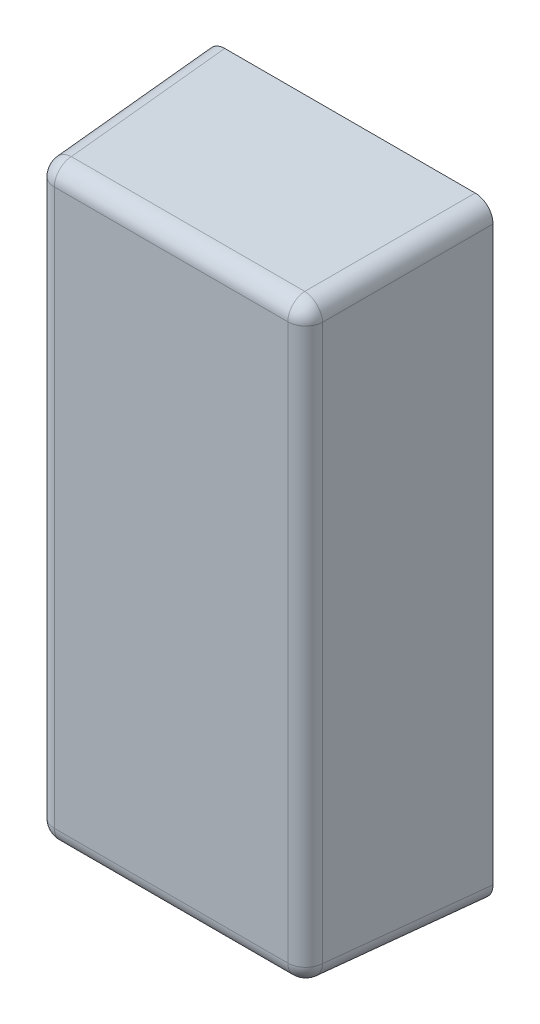
ISO-10303-21;
HEADER;
FILE_DESCRIPTION(('STEP AP214'),'2;1');
FILE_NAME('part.step','',(''),(''),'','','');
FILE_SCHEMA(('AUTOMOTIVE_DESIGN { 1 0 10303 214 1 1 1 1 }'));
ENDSEC;
DATA;
#1=APPLICATION_CONTEXT('core data for automotive mechanical design processes');
#2=APPLICATION_PROTOCOL_DEFINITION('international standard','automotive_design',2000,#1);
#3=PRODUCT_CONTEXT('',#1,'mechanical');
#4=PRODUCT('Part','Part','',(#3));
#5=PRODUCT_RELATED_PRODUCT_CATEGORY('part','',(#4));
#6=PRODUCT_DEFINITION_FORMATION('','',#4);
#7=PRODUCT_DEFINITION_CONTEXT('part definition',#1,'design');
#8=PRODUCT_DEFINITION('design','',#6,#7);
#9=PRODUCT_DEFINITION_SHAPE('','',#8);
#10=(LENGTH_UNIT() NAMED_UNIT(*) SI_UNIT(.MILLI.,.METRE.));
#11=(NAMED_UNIT(*) PLANE_ANGLE_UNIT() SI_UNIT($,.RADIAN.));
#12=(NAMED_UNIT(*) SI_UNIT($,.STERADIAN.) SOLID_ANGLE_UNIT());
#13=UNCERTAINTY_MEASURE_WITH_UNIT(LENGTH_MEASURE(1.E-05),#10,'distance_accuracy_value','');
#14=(GEOMETRIC_REPRESENTATION_CONTEXT(3) GLOBAL_UNCERTAINTY_ASSIGNED_CONTEXT((#13)) GLOBAL_UNIT_ASSIGNED_CONTEXT((#10,
#11,#12)) REPRESENTATION_CONTEXT('',''));
#15=CARTESIAN_POINT('',(0.,0.,0.));
#16=DIRECTION('',(0.,0.,1.));
#17=DIRECTION('',(1.,0.,0.));
#18=AXIS2_PLACEMENT_3D('',#15,#16,#17);
#19=CARTESIAN_POINT('',(-8.,-17.,0.));
#20=DIRECTION('',(-0.998629534754574,0.,0.0523359562429439));
#21=DIRECTION('',(0.052335956242944,0.,0.998629534754574));
#22=AXIS2_PLACEMENT_3D('',#19,#20,#21);
#23=PLANE('',#22);
#24=DIRECTION('',(0.,-1.,0.));
#25=VECTOR('',#24,1.);
#26=CARTESIAN_POINT('',(-8.,-17.,0.));
#27=LINE('',#26,#25);
#28=CARTESIAN_POINT('',(-8.,16.0013704652454,0.));
#29=VERTEX_POINT('',#28);
#30=CARTESIAN_POINT('',(-8.,-16.0013704652454,0.));
#31=VERTEX_POINT('',#30);
#32=EDGE_CURVE('E177',#29,#31,#27,.T.);
#33=ORIENTED_EDGE('',*,*,#32,.T.);
#34=DIRECTION('',(0.052264427688714,0.0522644276887141,0.997264688634237));
#35=VECTOR('',#34,1.);
#36=CARTESIAN_POINT('',(-8.00272782687933,-16.0040982921248,-0.0520500375449156));
#37=LINE('',#36,#35);
#38=CARTESIAN_POINT('',(-7.52558717520928,-15.5269576404547,9.05233595624295));
#39=VERTEX_POINT('',#38);
#40=EDGE_CURVE('E215',#31,#39,#37,.T.);
#41=ORIENTED_EDGE('',*,*,#40,.T.);
#42=DIRECTION('',(0.,-1.,0.));
#43=VECTOR('',#42,1.);
#44=CARTESIAN_POINT('',(-7.52558717520928,16.4759222071696,9.05233595624295));
#45=LINE('',#44,#43);
#46=CARTESIAN_POINT('',(-7.52558717520928,15.5269576404547,9.05233595624295));
#47=VERTEX_POINT('',#46);
#48=EDGE_CURVE('E213',#39,#47,#45,.F.);
#49=ORIENTED_EDGE('',*,*,#48,.T.);
#50=DIRECTION('',(0.052264427688714,-0.052264427688714,0.997264688634237));
#51=VECTOR('',#50,1.);
#52=CARTESIAN_POINT('',(-7.90985443322395,15.9112248984694,1.72007988144657));
#53=LINE('',#52,#51);
#54=EDGE_CURVE('E211',#47,#29,#53,.F.);
#55=ORIENTED_EDGE('',*,*,#54,.T.);
#56=EDGE_LOOP('',(#33,#41,#49,#55));
#57=FACE_BOUND('',#56,.T.);
#58=ADVANCED_FACE('F33',(#57),#23,.T.);
#59=CARTESIAN_POINT('',(8.,-17.,0.));
#60=DIRECTION('',(0.,-0.998629534754574,0.0523359562429439));
#61=DIRECTION('',(0.,-0.052335956242944,-0.998629534754574));
#62=AXIS2_PLACEMENT_3D('',#59,#60,#61);
#63=PLANE('',#62);
#64=DIRECTION('',(1.,0.,0.));
#65=VECTOR('',#64,1.);
#66=CARTESIAN_POINT('',(8.,-17.,0.));
#67=LINE('',#66,#65);
#68=CARTESIAN_POINT('',(-7.00137046524542,-17.,0.));
#69=VERTEX_POINT('',#68);
#70=CARTESIAN_POINT('',(7.00137046524543,-17.,0.));
#71=VERTEX_POINT('',#70);
#72=EDGE_CURVE('E180',#69,#71,#67,.T.);
#73=ORIENTED_EDGE('',*,*,#72,.T.);
#74=DIRECTION('',(-0.052264427688714,0.052264427688714,0.997264688634237));
#75=VECTOR('',#74,1.);
#76=CARTESIAN_POINT('',(7.00409829212476,-17.0027278268793,-0.0520500375449156));
#77=LINE('',#76,#75);
#78=CARTESIAN_POINT('',(6.52695764045471,-16.5255871752093,9.05233595624295));
#79=VERTEX_POINT('',#78);
#80=EDGE_CURVE('E203',#71,#79,#77,.T.);
#81=ORIENTED_EDGE('',*,*,#80,.T.);
#82=DIRECTION('',(1.,0.,0.));
#83=VECTOR('',#82,1.);
#84=CARTESIAN_POINT('',(-7.47592220716958,-16.5255871752093,9.05233595624295));
#85=LINE('',#84,#83);
#86=CARTESIAN_POINT('',(-6.5269576404547,-16.5255871752093,9.05233595624295));
#87=VERTEX_POINT('',#86);
#88=EDGE_CURVE('E200',#79,#87,#85,.F.);
#89=ORIENTED_EDGE('',*,*,#88,.T.);
#90=DIRECTION('',(0.0522644276887141,0.0522644276887141,0.997264688634237));
#91=VECTOR('',#90,1.);
#92=CARTESIAN_POINT('',(-6.96039316569869,-16.9590227004533,0.781893453745197));
#93=LINE('',#92,#91);
#94=EDGE_CURVE('E198',#87,#69,#93,.F.);
#95=ORIENTED_EDGE('',*,*,#94,.T.);
#96=EDGE_LOOP('',(#73,#81,#89,#95));
#97=FACE_BOUND('',#96,.T.);
#98=ADVANCED_FACE('F312',(#97),#63,.T.);
#99=CARTESIAN_POINT('',(8.,-17.,0.));
#100=DIRECTION('',(0.998629534754574,0.,0.0523359562429439));
#101=DIRECTION('',(0.052335956242944,0.,-0.998629534754574));
#102=AXIS2_PLACEMENT_3D('',#99,#100,#101);
#103=PLANE('',#102);
#104=DIRECTION('',(0.,1.,0.));
#105=VECTOR('',#104,1.);
#106=CARTESIAN_POINT('',(8.,-17.,0.));
#107=LINE('',#106,#105);
#108=CARTESIAN_POINT('',(8.,-16.0013704652454,0.));
#109=VERTEX_POINT('',#108);
#110=CARTESIAN_POINT('',(8.,16.0013704652454,0.));
#111=VERTEX_POINT('',#110);
#112=EDGE_CURVE('E184',#109,#111,#107,.T.);
#113=ORIENTED_EDGE('',*,*,#112,.T.);
#114=DIRECTION('',(-0.052264427688714,-0.0522644276887141,0.997264688634237));
#115=VECTOR('',#114,1.);
#116=CARTESIAN_POINT('',(7.90985443322395,15.9112248984694,1.72007988144657));
#117=LINE('',#116,#115);
#118=CARTESIAN_POINT('',(7.52558717520928,15.5269576404547,9.05233595624295));
#119=VERTEX_POINT('',#118);
#120=EDGE_CURVE('E56',#111,#119,#117,.T.);
#121=ORIENTED_EDGE('',*,*,#120,.T.);
#122=DIRECTION('',(0.,1.,0.));
#123=VECTOR('',#122,1.);
#124=CARTESIAN_POINT('',(7.52558717520928,-16.4759222071696,9.05233595624295));
#125=LINE('',#124,#123);
#126=CARTESIAN_POINT('',(7.52558717520928,-15.5269576404547,9.05233595624295));
#127=VERTEX_POINT('',#126);
#128=EDGE_CURVE('E219',#119,#127,#125,.F.);
#129=ORIENTED_EDGE('',*,*,#128,.T.);
#130=DIRECTION('',(-0.052264427688714,0.052264427688714,0.997264688634237));
#131=VECTOR('',#130,1.);
#132=CARTESIAN_POINT('',(8.00272782687933,-16.0040982921248,-0.0520500375449156));
#133=LINE('',#132,#131);
#134=EDGE_CURVE('E217',#127,#109,#133,.F.);
#135=ORIENTED_EDGE('',*,*,#134,.T.);
#136=EDGE_LOOP('',(#113,#121,#129,#135));
#137=FACE_BOUND('',#136,.T.);
#138=ADVANCED_FACE('F295',(#137),#103,.T.);
#139=CARTESIAN_POINT('',(8.,17.,0.));
#140=DIRECTION('',(0.,0.998629534754574,0.0523359562429439));
#141=DIRECTION('',(0.,-0.052335956242944,0.998629534754574));
#142=AXIS2_PLACEMENT_3D('',#139,#140,#141);
#143=PLANE('',#142);
#144=DIRECTION('',(-1.,0.,0.));
#145=VECTOR('',#144,1.);
#146=CARTESIAN_POINT('',(7.47592220716959,16.5255871752093,9.05233595624294));
#147=LINE('',#146,#145);
#148=CARTESIAN_POINT('',(-6.5269576404547,16.5255871752093,9.05233595624294));
#149=VERTEX_POINT('',#148);
#150=CARTESIAN_POINT('',(6.52695764045471,16.5255871752093,9.05233595624294));
#151=VERTEX_POINT('',#150);
#152=EDGE_CURVE('E207',#149,#151,#147,.F.);
#153=ORIENTED_EDGE('',*,*,#152,.T.);
#154=DIRECTION('',(-0.0522644276887141,-0.0522644276887141,0.997264688634237));
#155=VECTOR('',#154,1.);
#156=CARTESIAN_POINT('',(7.00409829212476,17.0027278268793,-0.0520500375449156));
#157=LINE('',#156,#155);
#158=CARTESIAN_POINT('',(7.00137046524543,17.,0.));
#159=VERTEX_POINT('',#158);
#160=EDGE_CURVE('E209',#151,#159,#157,.F.);
#161=ORIENTED_EDGE('',*,*,#160,.T.);
#162=DIRECTION('',(-1.,0.,0.));
#163=VECTOR('',#162,1.);
#164=CARTESIAN_POINT('',(8.,17.,0.));
#165=LINE('',#164,#163);
#166=CARTESIAN_POINT('',(-7.00137046524542,17.,0.));
#167=VERTEX_POINT('',#166);
#168=EDGE_CURVE('E186',#159,#167,#165,.T.);
#169=ORIENTED_EDGE('',*,*,#168,.T.);
#170=DIRECTION('',(0.052264427688714,-0.052264427688714,0.997264688634237));
#171=VECTOR('',#170,1.);
#172=CARTESIAN_POINT('',(-6.96039316569869,16.9590227004533,0.781893453745197));
#173=LINE('',#172,#171);
#174=EDGE_CURVE('E205',#167,#149,#173,.T.);
#175=ORIENTED_EDGE('',*,*,#174,.T.);
#176=EDGE_LOOP('',(#153,#161,#169,#175));
#177=FACE_BOUND('',#176,.T.);
#178=ADVANCED_FACE('F285',(#177),#143,.T.);
#179=CARTESIAN_POINT('',(0.,0.,10.));
#180=DIRECTION('',(0.,0.,1.));
#181=DIRECTION('',(1.,0.,0.));
#182=AXIS2_PLACEMENT_3D('',#179,#180,#181);
#183=PLANE('',#182);
#184=DIRECTION('',(1.,0.,0.));
#185=VECTOR('',#184,1.);
#186=CARTESIAN_POINT('',(-7.47592220716958,15.5269576404547,10.));
#187=LINE('',#186,#185);
#188=CARTESIAN_POINT('',(6.52695764045471,15.5269576404547,10.));
#189=VERTEX_POINT('',#188);
#190=CARTESIAN_POINT('',(-6.5269576404547,15.5269576404547,10.));
#191=VERTEX_POINT('',#190);
#192=EDGE_CURVE('E191',#189,#191,#187,.F.);
#193=ORIENTED_EDGE('',*,*,#192,.T.);
#194=DIRECTION('',(0.,1.,0.));
#195=VECTOR('',#194,1.);
#196=CARTESIAN_POINT('',(-6.5269576404547,-16.4759222071696,10.));
#197=LINE('',#196,#195);
#198=CARTESIAN_POINT('',(-6.5269576404547,-15.5269576404547,10.));
#199=VERTEX_POINT('',#198);
#200=EDGE_CURVE('E196',#191,#199,#197,.F.);
#201=ORIENTED_EDGE('',*,*,#200,.T.);
#202=DIRECTION('',(-1.,0.,0.));
#203=VECTOR('',#202,1.);
#204=CARTESIAN_POINT('',(7.47592220716959,-15.5269576404547,10.));
#205=LINE('',#204,#203);
#206=CARTESIAN_POINT('',(6.52695764045471,-15.5269576404547,10.));
#207=VERTEX_POINT('',#206);
#208=EDGE_CURVE('E193',#199,#207,#205,.F.);
#209=ORIENTED_EDGE('',*,*,#208,.T.);
#210=DIRECTION('',(0.,-1.,0.));
#211=VECTOR('',#210,1.);
#212=CARTESIAN_POINT('',(6.52695764045471,16.4759222071696,10.));
#213=LINE('',#212,#211);
#214=EDGE_CURVE('E189',#207,#189,#213,.F.);
#215=ORIENTED_EDGE('',*,*,#214,.T.);
#216=EDGE_LOOP('',(#193,#201,#209,#215));
#217=FACE_BOUND('',#216,.T.);
#218=ADVANCED_FACE('F275',(#217),#183,.T.);
#219=CARTESIAN_POINT('',(0.,0.,0.));
#220=DIRECTION('',(0.,0.,1.));
#221=DIRECTION('',(1.,0.,0.));
#222=AXIS2_PLACEMENT_3D('',#219,#220,#221);
#223=PLANE('',#222);
#224=DIRECTION('',(0.,-1.,0.));
#225=VECTOR('',#224,1.);
#226=CARTESIAN_POINT('',(6.99862765400208,-17.,0.));
#227=LINE('',#226,#225);
#228=CARTESIAN_POINT('',(6.99862765400208,-15.9986276540021,0.));
#229=VERTEX_POINT('',#228);
#230=CARTESIAN_POINT('',(6.99862765400208,15.9986276540021,0.));
#231=VERTEX_POINT('',#230);
#232=EDGE_CURVE('E173',#229,#231,#227,.F.);
#233=ORIENTED_EDGE('',*,*,#232,.T.);
#234=DIRECTION('',(1.,0.,0.));
#235=VECTOR('',#234,1.);
#236=CARTESIAN_POINT('',(8.,15.9986276540021,0.));
#237=LINE('',#236,#235);
#238=CARTESIAN_POINT('',(-6.99862765400208,15.9986276540021,0.));
#239=VERTEX_POINT('',#238);
#240=EDGE_CURVE('E157',#231,#239,#237,.F.);
#241=ORIENTED_EDGE('',*,*,#240,.T.);
#242=DIRECTION('',(0.,1.,0.));
#243=VECTOR('',#242,1.);
#244=CARTESIAN_POINT('',(-6.99862765400208,-17.,0.));
#245=LINE('',#244,#243);
#246=CARTESIAN_POINT('',(-6.99862765400208,-15.9986276540021,0.));
#247=VERTEX_POINT('',#246);
#248=EDGE_CURVE('E169',#239,#247,#245,.F.);
#249=ORIENTED_EDGE('',*,*,#248,.T.);
#250=DIRECTION('',(-1.,0.,0.));
#251=VECTOR('',#250,1.);
#252=CARTESIAN_POINT('',(8.,-15.9986276540021,0.));
#253=LINE('',#252,#251);
#254=EDGE_CURVE('E48',#247,#229,#253,.F.);
#255=ORIENTED_EDGE('',*,*,#254,.T.);
#256=EDGE_LOOP('',(#233,#241,#249,#255));
#257=FACE_BOUND('',#256,.T.);
#258=ORIENTED_EDGE('',*,*,#168,.F.);
#259=CARTESIAN_POINT('',(6.99862765400208,15.9986276540021,0.));
#260=DIRECTION('',(0.,0.,1.));
#261=DIRECTION('',(0.707106781186547,0.707106781186548,0.));
#262=AXIS2_PLACEMENT_3D('',#259,#260,#261);
#263=ELLIPSE('',#262,1.00274281381557,1.);
#264=EDGE_CURVE('E41',#159,#111,#263,.F.);
#265=ORIENTED_EDGE('',*,*,#264,.T.);
#266=ORIENTED_EDGE('',*,*,#112,.F.);
#267=CARTESIAN_POINT('',(6.99862765400208,-15.9986276540021,0.));
#268=DIRECTION('',(0.,0.,1.));
#269=DIRECTION('',(0.707106781186548,-0.707106781186547,0.));
#270=AXIS2_PLACEMENT_3D('',#267,#268,#269);
#271=ELLIPSE('',#270,1.00274281381557,1.);
#272=EDGE_CURVE('E226',#109,#71,#271,.F.);
#273=ORIENTED_EDGE('',*,*,#272,.T.);
#274=ORIENTED_EDGE('',*,*,#72,.F.);
#275=CARTESIAN_POINT('',(-6.99862765400208,-15.9986276540021,0.));
#276=DIRECTION('',(0.,0.,1.));
#277=DIRECTION('',(-0.707106781186547,-0.707106781186548,0.));
#278=AXIS2_PLACEMENT_3D('',#275,#276,#277);
#279=ELLIPSE('',#278,1.00274281381557,1.);
#280=EDGE_CURVE('E224',#69,#31,#279,.F.);
#281=ORIENTED_EDGE('',*,*,#280,.T.);
#282=ORIENTED_EDGE('',*,*,#32,.F.);
#283=CARTESIAN_POINT('',(-6.99862765400208,15.9986276540021,0.));
#284=DIRECTION('',(0.,0.,1.));
#285=DIRECTION('',(-0.707106781186548,0.707106781186547,0.));
#286=AXIS2_PLACEMENT_3D('',#283,#284,#285);
#287=ELLIPSE('',#286,1.00274281381557,1.);
#288=EDGE_CURVE('E222',#29,#167,#287,.F.);
#289=ORIENTED_EDGE('',*,*,#288,.T.);
#290=EDGE_LOOP('',(#258,#265,#266,#273,#274,#281,#282,#289));
#291=FACE_BOUND('',#290,.T.);
#292=ADVANCED_FACE('F293',(#257,#291),#223,.F.);
#293=CARTESIAN_POINT('',(-6.91122489846937,15.9112248984694,1.66774392520363));
#294=DIRECTION('',(-0.052264427688714,0.052264427688714,-0.997264688634237));
#295=DIRECTION('',(-0.998629534754574,0.,0.0523359562429439));
#296=AXIS2_PLACEMENT_3D('',#293,#294,#295);
#297=CYLINDRICAL_SURFACE('',#296,1.);
#298=ORIENTED_EDGE('',*,*,#288,.F.);
#299=ORIENTED_EDGE('',*,*,#54,.F.);
#300=CARTESIAN_POINT('',(-6.5269576404547,15.5269576404547,9.));
#301=DIRECTION('',(0.0522644276887164,-0.0522644276887148,0.997264688634237));
#302=DIRECTION('',(0.998629534754574,0.,-0.0523359562429464));
#303=AXIS2_PLACEMENT_3D('',#300,#301,#302);
#304=CIRCLE('',#303,1.);
#305=EDGE_CURVE('E181',#149,#47,#304,.T.);
#306=ORIENTED_EDGE('',*,*,#305,.F.);
#307=ORIENTED_EDGE('',*,*,#174,.F.);
#308=EDGE_LOOP('',(#298,#299,#306,#307));
#309=FACE_BOUND('',#308,.T.);
#310=ADVANCED_FACE('F35',(#309),#297,.T.);
#311=CARTESIAN_POINT('',(0.,15.5269576404547,9.));
#312=DIRECTION('',(-1.,0.,0.));
#313=DIRECTION('',(0.,-1.,0.));
#314=AXIS2_PLACEMENT_3D('',#311,#312,#313);
#315=CYLINDRICAL_SURFACE('',#314,1.);
#316=CARTESIAN_POINT('',(6.52695764045471,15.5269576404547,9.));
#317=DIRECTION('',(1.,0.,0.));
#318=DIRECTION('',(0.,0.,-1.));
#319=AXIS2_PLACEMENT_3D('',#316,#317,#318);
#320=CIRCLE('',#319,1.);
#321=EDGE_CURVE('E253',#151,#189,#320,.T.);
#322=ORIENTED_EDGE('',*,*,#321,.F.);
#323=ORIENTED_EDGE('',*,*,#152,.F.);
#324=CARTESIAN_POINT('',(-6.5269576404547,15.5269576404547,9.));
#325=DIRECTION('',(-1.,0.,0.));
#326=DIRECTION('',(0.,0.,1.));
#327=AXIS2_PLACEMENT_3D('',#324,#325,#326);
#328=CIRCLE('',#327,1.);
#329=EDGE_CURVE('E256',#191,#149,#328,.T.);
#330=ORIENTED_EDGE('',*,*,#329,.F.);
#331=ORIENTED_EDGE('',*,*,#192,.F.);
#332=EDGE_LOOP('',(#322,#323,#330,#331));
#333=FACE_BOUND('',#332,.T.);
#334=ADVANCED_FACE('F282',(#333),#315,.T.);
#335=CARTESIAN_POINT('',(7.00409829212476,16.0040982921248,-0.10438599378786));
#336=DIRECTION('',(0.052264427688714,0.0522644276887141,-0.997264688634237));
#337=DIRECTION('',(0.,0.998629534754574,0.052335956242944));
#338=AXIS2_PLACEMENT_3D('',#335,#336,#337);
#339=CYLINDRICAL_SURFACE('',#338,1.);
#340=ORIENTED_EDGE('',*,*,#264,.F.);
#341=ORIENTED_EDGE('',*,*,#160,.F.);
#342=CARTESIAN_POINT('',(6.52695764045471,15.5269576404547,9.));
#343=DIRECTION('',(-0.0522644276887149,-0.052264427688713,0.997264688634237));
#344=DIRECTION('',(0.998629534754574,0.,0.0523359562429448));
#345=AXIS2_PLACEMENT_3D('',#342,#343,#344);
#346=CIRCLE('',#345,1.);
#347=EDGE_CURVE('E250',#119,#151,#346,.T.);
#348=ORIENTED_EDGE('',*,*,#347,.F.);
#349=ORIENTED_EDGE('',*,*,#120,.F.);
#350=EDGE_LOOP('',(#340,#341,#348,#349));
#351=FACE_BOUND('',#350,.T.);
#352=ADVANCED_FACE('F289',(#351),#339,.T.);
#353=CARTESIAN_POINT('',(-6.52695764045471,15.5269576404547,9.));
#354=DIRECTION('',(0.,0.,1.));
#355=DIRECTION('',(1.,0.,0.));
#356=AXIS2_PLACEMENT_3D('',#353,#354,#355);
#357=SPHERICAL_SURFACE('',#356,1.);
#358=ORIENTED_EDGE('',*,*,#329,.T.);
#359=ORIENTED_EDGE('',*,*,#305,.T.);
#360=CARTESIAN_POINT('',(-6.52695764045471,15.5269576404547,9.));
#361=DIRECTION('',(0.,1.,0.));
#362=DIRECTION('',(0.,0.,1.));
#363=AXIS2_PLACEMENT_3D('',#360,#361,#362);
#364=CIRCLE('',#363,1.);
#365=EDGE_CURVE('E247',#191,#47,#364,.F.);
#366=ORIENTED_EDGE('',*,*,#365,.F.);
#367=EDGE_LOOP('',(#358,#359,#366));
#368=FACE_BOUND('',#367,.T.);
#369=ADVANCED_FACE('F262',(#368),#357,.T.);
#370=CARTESIAN_POINT('',(6.52695764045471,15.5269576404547,9.));
#371=DIRECTION('',(0.,0.,1.));
#372=DIRECTION('',(1.,0.,0.));
#373=AXIS2_PLACEMENT_3D('',#370,#371,#372);
#374=SPHERICAL_SURFACE('',#373,1.);
#375=ORIENTED_EDGE('',*,*,#347,.T.);
#376=ORIENTED_EDGE('',*,*,#321,.T.);
#377=CARTESIAN_POINT('',(6.52695764045471,15.5269576404547,9.));
#378=DIRECTION('',(0.,1.,0.));
#379=DIRECTION('',(-1.,0.,0.));
#380=AXIS2_PLACEMENT_3D('',#377,#378,#379);
#381=CIRCLE('',#380,1.);
#382=EDGE_CURVE('E244',#119,#189,#381,.F.);
#383=ORIENTED_EDGE('',*,*,#382,.F.);
#384=EDGE_LOOP('',(#375,#376,#383));
#385=FACE_BOUND('',#384,.T.);
#386=ADVANCED_FACE('F357',(#385),#374,.T.);
#387=CARTESIAN_POINT('',(-6.96039316569869,-15.9603931656987,0.729557497502253));
#388=DIRECTION('',(-0.052264427688714,-0.0522644276887141,-0.997264688634237));
#389=DIRECTION('',(0.,0.998629534754574,-0.052335956242944));
#390=AXIS2_PLACEMENT_3D('',#387,#388,#389);
#391=CYLINDRICAL_SURFACE('',#390,1.);
#392=ORIENTED_EDGE('',*,*,#280,.F.);
#393=ORIENTED_EDGE('',*,*,#94,.F.);
#394=CARTESIAN_POINT('',(-6.52695764045471,-15.5269576404547,9.));
#395=DIRECTION('',(0.0522644276887149,0.052264427688715,0.997264688634237));
#396=DIRECTION('',(0.,-0.998629534754574,0.0523359562429449));
#397=AXIS2_PLACEMENT_3D('',#394,#395,#396);
#398=CIRCLE('',#397,1.);
#399=EDGE_CURVE('E241',#39,#87,#398,.T.);
#400=ORIENTED_EDGE('',*,*,#399,.F.);
#401=ORIENTED_EDGE('',*,*,#40,.F.);
#402=EDGE_LOOP('',(#392,#393,#400,#401));
#403=FACE_BOUND('',#402,.T.);
#404=ADVANCED_FACE('F319',(#403),#391,.T.);
#405=CARTESIAN_POINT('',(-6.5269576404547,0.,9.));
#406=DIRECTION('',(0.,-1.,0.));
#407=DIRECTION('',(0.,0.,-1.));
#408=AXIS2_PLACEMENT_3D('',#405,#406,#407);
#409=CYLINDRICAL_SURFACE('',#408,1.);
#410=ORIENTED_EDGE('',*,*,#365,.T.);
#411=ORIENTED_EDGE('',*,*,#48,.F.);
#412=CARTESIAN_POINT('',(-6.5269576404547,-15.5269576404547,9.));
#413=DIRECTION('',(0.,-1.,0.));
#414=DIRECTION('',(1.,0.,0.));
#415=AXIS2_PLACEMENT_3D('',#412,#413,#414);
#416=CIRCLE('',#415,1.);
#417=EDGE_CURVE('E238',#199,#39,#416,.T.);
#418=ORIENTED_EDGE('',*,*,#417,.F.);
#419=ORIENTED_EDGE('',*,*,#200,.F.);
#420=EDGE_LOOP('',(#410,#411,#418,#419));
#421=FACE_BOUND('',#420,.T.);
#422=ADVANCED_FACE('F270',(#421),#409,.T.);
#423=CARTESIAN_POINT('',(6.52695764045471,0.,9.));
#424=DIRECTION('',(0.,1.,0.));
#425=DIRECTION('',(0.,0.,1.));
#426=AXIS2_PLACEMENT_3D('',#423,#424,#425);
#427=CYLINDRICAL_SURFACE('',#426,1.);
#428=ORIENTED_EDGE('',*,*,#382,.T.);
#429=ORIENTED_EDGE('',*,*,#214,.F.);
#430=CARTESIAN_POINT('',(6.52695764045471,-15.5269576404547,9.));
#431=DIRECTION('',(0.,-1.,0.));
#432=DIRECTION('',(0.,0.,-1.));
#433=AXIS2_PLACEMENT_3D('',#430,#431,#432);
#434=CIRCLE('',#433,1.);
#435=EDGE_CURVE('E235',#127,#207,#434,.T.);
#436=ORIENTED_EDGE('',*,*,#435,.F.);
#437=ORIENTED_EDGE('',*,*,#128,.F.);
#438=EDGE_LOOP('',(#428,#429,#436,#437));
#439=FACE_BOUND('',#438,.T.);
#440=ADVANCED_FACE('F305',(#439),#427,.T.);
#441=CARTESIAN_POINT('',(7.00409829212476,-16.0040982921248,-0.10438599378786));
#442=DIRECTION('',(0.052264427688714,-0.052264427688714,-0.997264688634237));
#443=DIRECTION('',(-0.998629534754574,0.,-0.0523359562429439));
#444=AXIS2_PLACEMENT_3D('',#441,#442,#443);
#445=CYLINDRICAL_SURFACE('',#444,1.);
#446=ORIENTED_EDGE('',*,*,#272,.F.);
#447=ORIENTED_EDGE('',*,*,#134,.F.);
#448=CARTESIAN_POINT('',(6.52695764045471,-15.5269576404547,9.));
#449=DIRECTION('',(-0.0522644276887148,0.0522644276887148,0.997264688634237));
#450=DIRECTION('',(0.,-0.998629534754574,0.0523359562429447));
#451=AXIS2_PLACEMENT_3D('',#448,#449,#450);
#452=CIRCLE('',#451,1.);
#453=EDGE_CURVE('E232',#79,#127,#452,.T.);
#454=ORIENTED_EDGE('',*,*,#453,.F.);
#455=ORIENTED_EDGE('',*,*,#80,.F.);
#456=EDGE_LOOP('',(#446,#447,#454,#455));
#457=FACE_BOUND('',#456,.T.);
#458=ADVANCED_FACE('F301',(#457),#445,.T.);
#459=CARTESIAN_POINT('',(-6.52695764045471,-15.5269576404547,9.));
#460=DIRECTION('',(0.,0.,1.));
#461=DIRECTION('',(1.,0.,0.));
#462=AXIS2_PLACEMENT_3D('',#459,#460,#461);
#463=SPHERICAL_SURFACE('',#462,1.);
#464=ORIENTED_EDGE('',*,*,#417,.T.);
#465=ORIENTED_EDGE('',*,*,#399,.T.);
#466=CARTESIAN_POINT('',(-6.5269576404547,-15.5269576404547,9.));
#467=DIRECTION('',(-1.,0.,0.));
#468=DIRECTION('',(0.,0.,1.));
#469=AXIS2_PLACEMENT_3D('',#466,#467,#468);
#470=CIRCLE('',#469,1.);
#471=EDGE_CURVE('E230',#199,#87,#470,.F.);
#472=ORIENTED_EDGE('',*,*,#471,.F.);
#473=EDGE_LOOP('',(#464,#465,#472));
#474=FACE_BOUND('',#473,.T.);
#475=ADVANCED_FACE('F345',(#474),#463,.T.);
#476=CARTESIAN_POINT('',(6.52695764045471,-15.5269576404547,9.));
#477=DIRECTION('',(0.,0.,1.));
#478=DIRECTION('',(1.,0.,0.));
#479=AXIS2_PLACEMENT_3D('',#476,#477,#478);
#480=SPHERICAL_SURFACE('',#479,1.);
#481=ORIENTED_EDGE('',*,*,#453,.T.);
#482=ORIENTED_EDGE('',*,*,#435,.T.);
#483=CARTESIAN_POINT('',(6.52695764045471,-15.5269576404547,9.));
#484=DIRECTION('',(1.,0.,0.));
#485=DIRECTION('',(0.,1.,0.));
#486=AXIS2_PLACEMENT_3D('',#483,#484,#485);
#487=CIRCLE('',#486,1.);
#488=EDGE_CURVE('E165',#79,#207,#487,.F.);
#489=ORIENTED_EDGE('',*,*,#488,.F.);
#490=EDGE_LOOP('',(#481,#482,#489));
#491=FACE_BOUND('',#490,.T.);
#492=ADVANCED_FACE('F308',(#491),#480,.T.);
#493=CARTESIAN_POINT('',(0.,-15.5269576404547,9.));
#494=DIRECTION('',(1.,0.,0.));
#495=DIRECTION('',(0.,1.,0.));
#496=AXIS2_PLACEMENT_3D('',#493,#494,#495);
#497=CYLINDRICAL_SURFACE('',#496,1.);
#498=ORIENTED_EDGE('',*,*,#471,.T.);
#499=ORIENTED_EDGE('',*,*,#88,.F.);
#500=ORIENTED_EDGE('',*,*,#488,.T.);
#501=ORIENTED_EDGE('',*,*,#208,.F.);
#502=EDGE_LOOP('',(#498,#499,#500,#501));
#503=FACE_BOUND('',#502,.T.);
#504=ADVANCED_FACE('F310',(#503),#497,.T.);
#505=CARTESIAN_POINT('',(-7.00137046524542,-17.,-0.0523359562429439));
#506=DIRECTION('',(-0.998629534754574,0.,0.0523359562429439));
#507=DIRECTION('',(0.052335956242944,0.,0.998629534754574));
#508=AXIS2_PLACEMENT_3D('',#505,#506,#507);
#509=PLANE('',#508);
#510=ORIENTED_EDGE('',*,*,#248,.F.);
#511=DIRECTION('',(-0.052264427688714,0.052264427688714,-0.997264688634237));
#512=VECTOR('',#511,1.);
#513=CARTESIAN_POINT('',(-6.91122489846937,15.9112248984694,1.66774392520363));
#514=LINE('',#513,#512);
#515=CARTESIAN_POINT('',(-6.52695764045471,15.5269576404547,9.));
#516=VERTEX_POINT('',#515);
#517=EDGE_CURVE('E142',#516,#239,#514,.T.);
#518=ORIENTED_EDGE('',*,*,#517,.F.);
#519=DIRECTION('',(0.,-1.,0.));
#520=VECTOR('',#519,1.);
#521=CARTESIAN_POINT('',(-6.5269576404547,0.,9.));
#522=LINE('',#521,#520);
#523=CARTESIAN_POINT('',(-6.52695764045471,-15.5269576404547,9.));
#524=VERTEX_POINT('',#523);
#525=EDGE_CURVE('E136',#524,#516,#522,.F.);
#526=ORIENTED_EDGE('',*,*,#525,.F.);
#527=DIRECTION('',(-0.052264427688714,-0.0522644276887141,-0.997264688634237));
#528=VECTOR('',#527,1.);
#529=CARTESIAN_POINT('',(-6.96039316569869,-15.9603931656987,0.729557497502253));
#530=LINE('',#529,#528);
#531=EDGE_CURVE('E140',#524,#247,#530,.T.);
#532=ORIENTED_EDGE('',*,*,#531,.T.);
#533=EDGE_LOOP('',(#510,#518,#526,#532));
#534=FACE_BOUND('',#533,.T.);
#535=ADVANCED_FACE('F139',(#534),#509,.F.);
#536=CARTESIAN_POINT('',(8.,-16.0013704652454,-0.0523359562429439));
#537=DIRECTION('',(0.,-0.998629534754574,0.0523359562429439));
#538=DIRECTION('',(0.,-0.052335956242944,-0.998629534754574));
#539=AXIS2_PLACEMENT_3D('',#536,#537,#538);
#540=PLANE('',#539);
#541=ORIENTED_EDGE('',*,*,#254,.F.);
#542=ORIENTED_EDGE('',*,*,#531,.F.);
#543=DIRECTION('',(1.,0.,0.));
#544=VECTOR('',#543,1.);
#545=CARTESIAN_POINT('',(0.,-15.5269576404547,9.));
#546=LINE('',#545,#544);
#547=CARTESIAN_POINT('',(6.52695764045471,-15.5269576404547,9.));
#548=VERTEX_POINT('',#547);
#549=EDGE_CURVE('E149',#548,#524,#546,.F.);
#550=ORIENTED_EDGE('',*,*,#549,.F.);
#551=DIRECTION('',(0.052264427688714,-0.052264427688714,-0.997264688634237));
#552=VECTOR('',#551,1.);
#553=CARTESIAN_POINT('',(7.00409829212476,-16.0040982921248,-0.10438599378786));
#554=LINE('',#553,#552);
#555=EDGE_CURVE('E145',#548,#229,#554,.T.);
#556=ORIENTED_EDGE('',*,*,#555,.T.);
#557=EDGE_LOOP('',(#541,#542,#550,#556));
#558=FACE_BOUND('',#557,.T.);
#559=ADVANCED_FACE('F155',(#558),#540,.F.);
#560=CARTESIAN_POINT('',(7.00137046524543,-17.,-0.0523359562429439));
#561=DIRECTION('',(0.998629534754574,0.,0.0523359562429439));
#562=DIRECTION('',(0.052335956242944,0.,-0.998629534754574));
#563=AXIS2_PLACEMENT_3D('',#560,#561,#562);
#564=PLANE('',#563);
#565=ORIENTED_EDGE('',*,*,#232,.F.);
#566=ORIENTED_EDGE('',*,*,#555,.F.);
#567=DIRECTION('',(0.,-1.,0.));
#568=VECTOR('',#567,1.);
#569=CARTESIAN_POINT('',(6.52695764045471,-17.,9.));
#570=LINE('',#569,#568);
#571=CARTESIAN_POINT('',(6.52695764045471,15.5269576404547,9.));
#572=VERTEX_POINT('',#571);
#573=EDGE_CURVE('E152',#548,#572,#570,.F.);
#574=ORIENTED_EDGE('',*,*,#573,.T.);
#575=DIRECTION('',(0.052264427688714,0.0522644276887141,-0.997264688634237));
#576=VECTOR('',#575,1.);
#577=CARTESIAN_POINT('',(7.00409829212476,16.0040982921248,-0.10438599378786));
#578=LINE('',#577,#576);
#579=EDGE_CURVE('E164',#572,#231,#578,.T.);
#580=ORIENTED_EDGE('',*,*,#579,.T.);
#581=EDGE_LOOP('',(#565,#566,#574,#580));
#582=FACE_BOUND('',#581,.T.);
#583=ADVANCED_FACE('F417',(#582),#564,.F.);
#584=CARTESIAN_POINT('',(8.,16.0013704652454,-0.0523359562429439));
#585=DIRECTION('',(0.,0.998629534754574,0.0523359562429439));
#586=DIRECTION('',(0.,-0.052335956242944,0.998629534754574));
#587=AXIS2_PLACEMENT_3D('',#584,#585,#586);
#588=PLANE('',#587);
#589=DIRECTION('',(-1.,0.,0.));
#590=VECTOR('',#589,1.);
#591=CARTESIAN_POINT('',(0.,15.5269576404547,9.));
#592=LINE('',#591,#590);
#593=EDGE_CURVE('E153',#516,#572,#592,.F.);
#594=ORIENTED_EDGE('',*,*,#593,.F.);
#595=ORIENTED_EDGE('',*,*,#517,.T.);
#596=ORIENTED_EDGE('',*,*,#240,.F.);
#597=ORIENTED_EDGE('',*,*,#579,.F.);
#598=EDGE_LOOP('',(#594,#595,#596,#597));
#599=FACE_BOUND('',#598,.T.);
#600=ADVANCED_FACE('F424',(#599),#588,.F.);
#601=CARTESIAN_POINT('',(0.,0.,9.));
#602=DIRECTION('',(0.,0.,1.));
#603=DIRECTION('',(1.,0.,0.));
#604=AXIS2_PLACEMENT_3D('',#601,#602,#603);
#605=PLANE('',#604);
#606=CARTESIAN_POINT('',(0.,0.,9.));
#607=DIRECTION('',(0.,0.,1.));
#608=DIRECTION('',(1.,0.,0.));
#609=AXIS2_PLACEMENT_3D('',#606,#607,#608);
#610=CIRCLE('',#609,3.);
#611=CARTESIAN_POINT('',(3.,0.,9.));
#612=VERTEX_POINT('',#611);
#613=EDGE_CURVE('E11',#612,#612,#610,.F.);
#614=ORIENTED_EDGE('',*,*,#613,.F.);
#615=EDGE_LOOP('',(#614));
#616=FACE_BOUND('',#615,.T.);
#617=ORIENTED_EDGE('',*,*,#593,.T.);
#618=ORIENTED_EDGE('',*,*,#573,.F.);
#619=ORIENTED_EDGE('',*,*,#549,.T.);
#620=ORIENTED_EDGE('',*,*,#525,.T.);
#621=EDGE_LOOP('',(#617,#618,#619,#620));
#622=FACE_BOUND('',#621,.T.);
#623=ADVANCED_FACE('F150',(#616,#622),#605,.F.);
#624=CARTESIAN_POINT('',(0.,0.,-8.48528137423857));
#625=DIRECTION('',(0.,0.,1.));
#626=DIRECTION('',(1.,0.,0.));
#627=AXIS2_PLACEMENT_3D('',#624,#625,#626);
#628=CYLINDRICAL_SURFACE('',#627,3.);
#629=CARTESIAN_POINT('',(0.,0.,0.));
#630=DIRECTION('',(0.,0.,1.));
#631=DIRECTION('',(1.,0.,0.));
#632=AXIS2_PLACEMENT_3D('',#629,#630,#631);
#633=CIRCLE('',#632,3.);
#634=CARTESIAN_POINT('',(3.,0.,0.));
#635=VERTEX_POINT('',#634);
#636=EDGE_CURVE('E557',#635,#635,#633,.T.);
#637=ORIENTED_EDGE('',*,*,#636,.T.);
#638=EDGE_LOOP('',(#637));
#639=FACE_BOUND('',#638,.T.);
#640=ORIENTED_EDGE('',*,*,#613,.T.);
#641=EDGE_LOOP('',(#640));
#642=FACE_BOUND('',#641,.T.);
#643=ADVANCED_FACE('F439',(#639,#642),#628,.T.);
#644=CARTESIAN_POINT('',(0.,0.,-8.48528137423857));
#645=DIRECTION('',(0.,0.,1.));
#646=DIRECTION('',(1.,0.,0.));
#647=AXIS2_PLACEMENT_3D('',#644,#645,#646);
#648=CYLINDRICAL_SURFACE('',#647,1.5);
#649=CARTESIAN_POINT('',(0.,0.,0.));
#650=DIRECTION('',(0.,0.,1.));
#651=DIRECTION('',(1.,0.,0.));
#652=AXIS2_PLACEMENT_3D('',#649,#650,#651);
#653=CIRCLE('',#652,1.5);
#654=CARTESIAN_POINT('',(1.5,0.,0.));
#655=VERTEX_POINT('',#654);
#656=EDGE_CURVE('E160',#655,#655,#653,.T.);
#657=ORIENTED_EDGE('',*,*,#656,.F.);
#658=EDGE_LOOP('',(#657));
#659=FACE_BOUND('',#658,.T.);
#660=CARTESIAN_POINT('',(0.,0.,9.));
#661=DIRECTION('',(0.,0.,-1.));
#662=DIRECTION('',(-1.,0.,0.));
#663=AXIS2_PLACEMENT_3D('',#660,#661,#662);
#664=CIRCLE('',#663,1.5);
#665=CARTESIAN_POINT('',(-1.5,0.,9.));
#666=VERTEX_POINT('',#665);
#667=EDGE_CURVE('E555',#666,#666,#664,.T.);
#668=ORIENTED_EDGE('',*,*,#667,.F.);
#669=EDGE_LOOP('',(#668));
#670=FACE_BOUND('',#669,.T.);
#671=ADVANCED_FACE('F448',(#659,#670),#648,.F.);
#672=CARTESIAN_POINT('',(0.,0.,0.));
#673=DIRECTION('',(0.,0.,1.));
#674=DIRECTION('',(1.,0.,0.));
#675=AXIS2_PLACEMENT_3D('',#672,#673,#674);
#676=PLANE('',#675);
#677=ORIENTED_EDGE('',*,*,#656,.T.);
#678=EDGE_LOOP('',(#677));
#679=FACE_BOUND('',#678,.T.);
#680=ORIENTED_EDGE('',*,*,#636,.F.);
#681=EDGE_LOOP('',(#680));
#682=FACE_BOUND('',#681,.T.);
#683=ADVANCED_FACE('F456',(#679,#682),#676,.F.);
#684=ORIENTED_EDGE('',*,*,#667,.T.);
#685=EDGE_LOOP('',(#684));
#686=FACE_BOUND('',#685,.T.);
#687=ADVANCED_FACE('F442',(#686),#605,.F.);
#688=CLOSED_SHELL('',(#58,#98,#138,#178,#218,#292,#310,#334,#352,#369,#386,#404,#422,#440,#458,
#475,#492,#504,#535,#559,#583,#600,#623,#643,#671,#683,#687));
#689=MANIFOLD_SOLID_BREP('B2',#688);
#690=ADVANCED_BREP_SHAPE_REPRESENTATION('',(#18,#689),#14);
#691=SHAPE_DEFINITION_REPRESENTATION(#9,#690);
ENDSEC;
END-ISO-10303-21;
